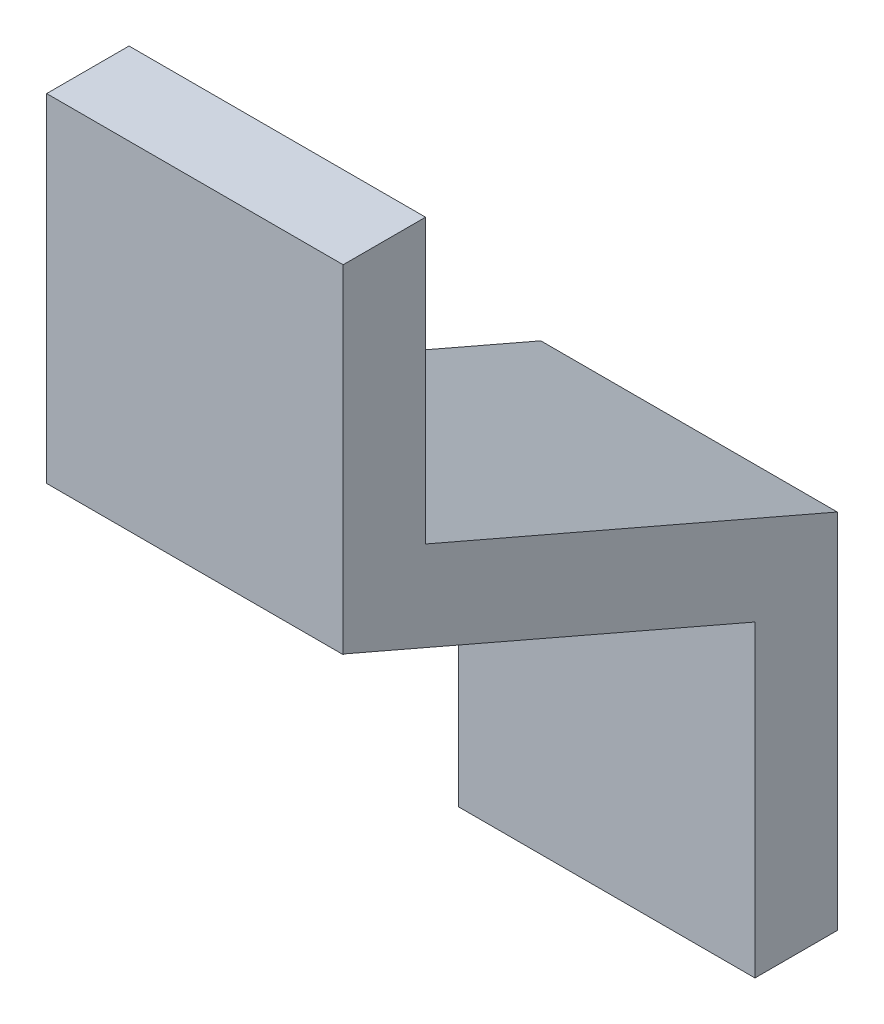
ISO-10303-21;
HEADER;
FILE_DESCRIPTION(('STEP AP214'),'2;1');
FILE_NAME('part.step','',(''),(''),'','','');
FILE_SCHEMA(('AUTOMOTIVE_DESIGN { 1 0 10303 214 1 1 1 1 }'));
ENDSEC;
DATA;
#1=APPLICATION_CONTEXT('core data for automotive mechanical design processes');
#2=APPLICATION_PROTOCOL_DEFINITION('international standard','automotive_design',2000,#1);
#3=PRODUCT_CONTEXT('',#1,'mechanical');
#4=PRODUCT('Part','Part','',(#3));
#5=PRODUCT_RELATED_PRODUCT_CATEGORY('part','',(#4));
#6=PRODUCT_DEFINITION_FORMATION('','',#4);
#7=PRODUCT_DEFINITION_CONTEXT('part definition',#1,'design');
#8=PRODUCT_DEFINITION('design','',#6,#7);
#9=PRODUCT_DEFINITION_SHAPE('','',#8);
#10=(LENGTH_UNIT() NAMED_UNIT(*) SI_UNIT(.MILLI.,.METRE.));
#11=(NAMED_UNIT(*) PLANE_ANGLE_UNIT() SI_UNIT($,.RADIAN.));
#12=(NAMED_UNIT(*) SI_UNIT($,.STERADIAN.) SOLID_ANGLE_UNIT());
#13=UNCERTAINTY_MEASURE_WITH_UNIT(LENGTH_MEASURE(1.E-05),#10,'distance_accuracy_value','');
#14=(GEOMETRIC_REPRESENTATION_CONTEXT(3) GLOBAL_UNCERTAINTY_ASSIGNED_CONTEXT((#13)) GLOBAL_UNIT_ASSIGNED_CONTEXT((#10,
#11,#12)) REPRESENTATION_CONTEXT('',''));
#15=CARTESIAN_POINT('',(0.,0.,0.));
#16=DIRECTION('',(0.,0.,1.));
#17=DIRECTION('',(1.,0.,0.));
#18=AXIS2_PLACEMENT_3D('',#15,#16,#17);
#19=CARTESIAN_POINT('',(6.62,0.999999996424,0.5));
#20=DIRECTION('',(0.,1.,0.));
#21=DIRECTION('',(0.,0.,1.));
#22=AXIS2_PLACEMENT_3D('',#19,#20,#21);
#23=PLANE('',#22);
#24=DIRECTION('',(1.,0.,0.));
#25=VECTOR('',#24,1.);
#26=CARTESIAN_POINT('',(6.62,0.999999996424,0.5));
#27=LINE('',#26,#25);
#28=CARTESIAN_POINT('',(6.980000014305,0.999999996424,0.5));
#29=VERTEX_POINT('',#28);
#30=CARTESIAN_POINT('',(6.62,0.999999996424,0.5));
#31=VERTEX_POINT('',#30);
#32=EDGE_CURVE('E140',#29,#31,#27,.F.);
#33=ORIENTED_EDGE('',*,*,#32,.T.);
#34=DIRECTION('',(0.,0.,-1.));
#35=VECTOR('',#34,1.);
#36=CARTESIAN_POINT('',(6.62,0.999999996424,0.));
#37=LINE('',#36,#35);
#38=CARTESIAN_POINT('',(6.62,0.999999996424,0.60000000149));
#39=VERTEX_POINT('',#38);
#40=EDGE_CURVE('E133',#31,#39,#37,.F.);
#41=ORIENTED_EDGE('',*,*,#40,.T.);
#42=DIRECTION('',(1.,0.,0.));
#43=VECTOR('',#42,1.);
#44=CARTESIAN_POINT('',(6.62,0.999999996424,0.60000000149));
#45=LINE('',#44,#43);
#46=CARTESIAN_POINT('',(6.980000014305,0.999999996424,0.60000000149));
#47=VERTEX_POINT('',#46);
#48=EDGE_CURVE('E129',#47,#39,#45,.F.);
#49=ORIENTED_EDGE('',*,*,#48,.F.);
#50=DIRECTION('',(0.,0.,-1.));
#51=VECTOR('',#50,1.);
#52=CARTESIAN_POINT('',(6.980000014305,0.999999996424,0.));
#53=LINE('',#52,#51);
#54=EDGE_CURVE('E106',#29,#47,#53,.F.);
#55=ORIENTED_EDGE('',*,*,#54,.F.);
#56=EDGE_LOOP('',(#33,#41,#49,#55));
#57=FACE_BOUND('',#56,.T.);
#58=ADVANCED_FACE('F17',(#57),#23,.T.);
#59=CARTESIAN_POINT('',(6.62,0.59,0.60000000149));
#60=DIRECTION('',(0.,0.,1.));
#61=DIRECTION('',(1.,0.,0.));
#62=AXIS2_PLACEMENT_3D('',#59,#60,#61);
#63=PLANE('',#62);
#64=DIRECTION('',(0.,1.,0.));
#65=VECTOR('',#64,1.);
#66=CARTESIAN_POINT('',(6.62,0.44,0.60000000149));
#67=LINE('',#66,#65);
#68=CARTESIAN_POINT('',(6.62,0.59,0.60000000149));
#69=VERTEX_POINT('',#68);
#70=EDGE_CURVE('E136',#39,#69,#67,.F.);
#71=ORIENTED_EDGE('',*,*,#70,.T.);
#72=DIRECTION('',(1.,0.,0.));
#73=VECTOR('',#72,1.);
#74=CARTESIAN_POINT('',(6.62,0.59,0.60000000149));
#75=LINE('',#74,#73);
#76=CARTESIAN_POINT('',(6.980000014305,0.59,0.60000000149));
#77=VERTEX_POINT('',#76);
#78=EDGE_CURVE('E92',#69,#77,#75,.T.);
#79=ORIENTED_EDGE('',*,*,#78,.T.);
#80=DIRECTION('',(0.,1.,0.));
#81=VECTOR('',#80,1.);
#82=CARTESIAN_POINT('',(6.980000014305,0.44,0.60000000149));
#83=LINE('',#82,#81);
#84=EDGE_CURVE('E73',#47,#77,#83,.F.);
#85=ORIENTED_EDGE('',*,*,#84,.F.);
#86=ORIENTED_EDGE('',*,*,#48,.T.);
#87=EDGE_LOOP('',(#71,#79,#85,#86));
#88=FACE_BOUND('',#87,.T.);
#89=ADVANCED_FACE('F285',(#88),#63,.T.);
#90=CARTESIAN_POINT('',(6.62,0.59,0.5));
#91=DIRECTION('',(0.,1.,0.));
#92=DIRECTION('',(0.,0.,1.));
#93=AXIS2_PLACEMENT_3D('',#90,#91,#92);
#94=PLANE('',#93);
#95=DIRECTION('',(1.,0.,0.));
#96=VECTOR('',#95,1.);
#97=CARTESIAN_POINT('',(6.62,0.590000000000416,0.59842599626982));
#98=LINE('',#97,#96);
#99=CARTESIAN_POINT('',(6.980000014305,0.590000000000104,0.598425996269911));
#100=VERTEX_POINT('',#99);
#101=CARTESIAN_POINT('',(6.62,0.590000000000104,0.59842599626991));
#102=VERTEX_POINT('',#101);
#103=EDGE_CURVE('E84',#100,#102,#98,.F.);
#104=ORIENTED_EDGE('',*,*,#103,.F.);
#105=DIRECTION('',(0.,0.,-1.));
#106=VECTOR('',#105,1.);
#107=CARTESIAN_POINT('',(6.980000014305,0.59,0.));
#108=LINE('',#107,#106);
#109=EDGE_CURVE('E20',#77,#100,#108,.T.);
#110=ORIENTED_EDGE('',*,*,#109,.F.);
#111=ORIENTED_EDGE('',*,*,#78,.F.);
#112=DIRECTION('',(0.,0.,1.));
#113=VECTOR('',#112,1.);
#114=CARTESIAN_POINT('',(6.62,0.59,0.5));
#115=LINE('',#114,#113);
#116=EDGE_CURVE('E87',#69,#102,#115,.F.);
#117=ORIENTED_EDGE('',*,*,#116,.T.);
#118=EDGE_LOOP('',(#104,#110,#111,#117));
#119=FACE_BOUND('',#118,.T.);
#120=ADVANCED_FACE('F85',(#119),#94,.F.);
#121=CARTESIAN_POINT('',(6.62,0.348224508223,0.03971472531736));
#122=DIRECTION('',(0.,-0.917754904098641,0.397147247255844));
#123=DIRECTION('',(0.,-0.397147247255844,-0.917754904098641));
#124=AXIS2_PLACEMENT_3D('',#121,#122,#123);
#125=PLANE('',#124);
#126=DIRECTION('',(0.,-0.397147247255413,-0.917754904098827));
#127=VECTOR('',#126,1.);
#128=CARTESIAN_POINT('',(6.980000014305,0.59,0.59842599627));
#129=LINE('',#128,#127);
#130=CARTESIAN_POINT('',(6.980000014305,0.37431222660502,0.10000000149));
#131=VERTEX_POINT('',#130);
#132=EDGE_CURVE('E80',#100,#131,#129,.T.);
#133=ORIENTED_EDGE('',*,*,#132,.F.);
#134=ORIENTED_EDGE('',*,*,#103,.T.);
#135=DIRECTION('',(0.,-0.397147247255413,-0.917754904098827));
#136=VECTOR('',#135,1.);
#137=CARTESIAN_POINT('',(6.62,0.59,0.59842599627));
#138=LINE('',#137,#136);
#139=CARTESIAN_POINT('',(6.62,0.374312226605,0.10000000149));
#140=VERTEX_POINT('',#139);
#141=EDGE_CURVE('E122',#102,#140,#138,.T.);
#142=ORIENTED_EDGE('',*,*,#141,.T.);
#143=DIRECTION('',(1.,0.,0.));
#144=VECTOR('',#143,1.);
#145=CARTESIAN_POINT('',(6.62,0.374312226605,0.10000000149));
#146=LINE('',#145,#144);
#147=EDGE_CURVE('E91',#131,#140,#146,.F.);
#148=ORIENTED_EDGE('',*,*,#147,.F.);
#149=EDGE_LOOP('',(#133,#134,#142,#148));
#150=FACE_BOUND('',#149,.T.);
#151=ADVANCED_FACE('F94',(#150),#125,.T.);
#152=CARTESIAN_POINT('',(6.62,0.,0.10000000149));
#153=DIRECTION('',(0.,0.,1.));
#154=DIRECTION('',(1.,0.,0.));
#155=AXIS2_PLACEMENT_3D('',#152,#153,#154);
#156=PLANE('',#155);
#157=ORIENTED_EDGE('',*,*,#147,.T.);
#158=DIRECTION('',(0.,1.,0.));
#159=VECTOR('',#158,1.);
#160=CARTESIAN_POINT('',(6.62,0.44,0.10000000149));
#161=LINE('',#160,#159);
#162=CARTESIAN_POINT('',(6.62,0.,0.10000000149));
#163=VERTEX_POINT('',#162);
#164=EDGE_CURVE('E118',#140,#163,#161,.F.);
#165=ORIENTED_EDGE('',*,*,#164,.T.);
#166=DIRECTION('',(1.,0.,0.));
#167=VECTOR('',#166,1.);
#168=CARTESIAN_POINT('',(6.62,0.,0.10000000149));
#169=LINE('',#168,#167);
#170=CARTESIAN_POINT('',(6.980000014305,0.,0.10000000149));
#171=VERTEX_POINT('',#170);
#172=EDGE_CURVE('E115',#163,#171,#169,.T.);
#173=ORIENTED_EDGE('',*,*,#172,.T.);
#174=DIRECTION('',(0.,1.,0.));
#175=VECTOR('',#174,1.);
#176=CARTESIAN_POINT('',(6.980000014305,0.44,0.10000000149));
#177=LINE('',#176,#175);
#178=EDGE_CURVE('E96',#131,#171,#177,.F.);
#179=ORIENTED_EDGE('',*,*,#178,.F.);
#180=EDGE_LOOP('',(#157,#165,#173,#179));
#181=FACE_BOUND('',#180,.T.);
#182=ADVANCED_FACE('F202',(#181),#156,.T.);
#183=CARTESIAN_POINT('',(6.62,0.,0.));
#184=DIRECTION('',(0.,1.,0.));
#185=DIRECTION('',(0.,0.,1.));
#186=AXIS2_PLACEMENT_3D('',#183,#184,#185);
#187=PLANE('',#186);
#188=DIRECTION('',(0.,0.,-1.));
#189=VECTOR('',#188,1.);
#190=CARTESIAN_POINT('',(6.62,0.,0.));
#191=LINE('',#190,#189);
#192=CARTESIAN_POINT('',(6.62,0.,0.));
#193=VERTEX_POINT('',#192);
#194=EDGE_CURVE('E121',#163,#193,#191,.T.);
#195=ORIENTED_EDGE('',*,*,#194,.T.);
#196=DIRECTION('',(1.,0.,0.));
#197=VECTOR('',#196,1.);
#198=CARTESIAN_POINT('',(6.62,0.,0.));
#199=LINE('',#198,#197);
#200=CARTESIAN_POINT('',(6.980000014305,0.,0.));
#201=VERTEX_POINT('',#200);
#202=EDGE_CURVE('E112',#193,#201,#199,.T.);
#203=ORIENTED_EDGE('',*,*,#202,.T.);
#204=DIRECTION('',(0.,0.,-1.));
#205=VECTOR('',#204,1.);
#206=CARTESIAN_POINT('',(6.980000014305,0.,0.));
#207=LINE('',#206,#205);
#208=EDGE_CURVE('E98',#171,#201,#207,.T.);
#209=ORIENTED_EDGE('',*,*,#208,.F.);
#210=ORIENTED_EDGE('',*,*,#172,.F.);
#211=EDGE_LOOP('',(#195,#203,#209,#210));
#212=FACE_BOUND('',#211,.T.);
#213=ADVANCED_FACE('F206',(#212),#187,.F.);
#214=CARTESIAN_POINT('',(6.62,0.,0.));
#215=DIRECTION('',(0.,0.,1.));
#216=DIRECTION('',(1.,0.,0.));
#217=AXIS2_PLACEMENT_3D('',#214,#215,#216);
#218=PLANE('',#217);
#219=ORIENTED_EDGE('',*,*,#202,.F.);
#220=DIRECTION('',(0.,1.,0.));
#221=VECTOR('',#220,1.);
#222=CARTESIAN_POINT('',(6.62,0.44,0.));
#223=LINE('',#222,#221);
#224=CARTESIAN_POINT('',(6.62,0.439999998997445,-1.94673175919965E-10));
#225=VERTEX_POINT('',#224);
#226=EDGE_CURVE('E178',#193,#225,#223,.T.);
#227=ORIENTED_EDGE('',*,*,#226,.T.);
#228=DIRECTION('',(1.,0.,0.));
#229=VECTOR('',#228,1.);
#230=CARTESIAN_POINT('',(6.62,0.43999999966303,-7.78692710220355E-10));
#231=LINE('',#230,#229);
#232=CARTESIAN_POINT('',(6.980000014305,0.439999998997445,-1.94673175919965E-10));
#233=VERTEX_POINT('',#232);
#234=EDGE_CURVE('E163',#225,#233,#231,.T.);
#235=ORIENTED_EDGE('',*,*,#234,.T.);
#236=DIRECTION('',(0.,1.,0.));
#237=VECTOR('',#236,1.);
#238=CARTESIAN_POINT('',(6.980000014305,0.44,0.));
#239=LINE('',#238,#237);
#240=EDGE_CURVE('E109',#201,#233,#239,.T.);
#241=ORIENTED_EDGE('',*,*,#240,.F.);
#242=EDGE_LOOP('',(#219,#227,#235,#241));
#243=FACE_BOUND('',#242,.T.);
#244=ADVANCED_FACE('F186',(#243),#218,.F.);
#245=CARTESIAN_POINT('',(6.980000014305,0.44,0.));
#246=DIRECTION('',(1.,0.,0.));
#247=DIRECTION('',(0.,0.,-1.));
#248=AXIS2_PLACEMENT_3D('',#245,#246,#247);
#249=PLANE('',#248);
#250=ORIENTED_EDGE('',*,*,#178,.T.);
#251=ORIENTED_EDGE('',*,*,#208,.T.);
#252=ORIENTED_EDGE('',*,*,#240,.T.);
#253=DIRECTION('',(0.,-0.397147247255844,-0.917754904098641));
#254=VECTOR('',#253,1.);
#255=CARTESIAN_POINT('',(6.980000014305,0.44,0.));
#256=LINE('',#255,#254);
#257=CARTESIAN_POINT('',(6.980000014305,0.656368904967003,0.499999999999999));
#258=VERTEX_POINT('',#257);
#259=EDGE_CURVE('E151',#233,#258,#256,.F.);
#260=ORIENTED_EDGE('',*,*,#259,.T.);
#261=DIRECTION('',(0.,1.,0.));
#262=VECTOR('',#261,1.);
#263=CARTESIAN_POINT('',(6.980000014305,0.59,0.5));
#264=LINE('',#263,#262);
#265=EDGE_CURVE('E144',#258,#29,#264,.T.);
#266=ORIENTED_EDGE('',*,*,#265,.T.);
#267=ORIENTED_EDGE('',*,*,#54,.T.);
#268=ORIENTED_EDGE('',*,*,#84,.T.);
#269=ORIENTED_EDGE('',*,*,#109,.T.);
#270=ORIENTED_EDGE('',*,*,#132,.T.);
#271=EDGE_LOOP('',(#250,#251,#252,#260,#266,#267,#268,#269,#270));
#272=FACE_BOUND('',#271,.T.);
#273=ADVANCED_FACE('F78',(#272),#249,.T.);
#274=CARTESIAN_POINT('',(6.62,0.59,0.5));
#275=DIRECTION('',(0.,0.,1.));
#276=DIRECTION('',(1.,0.,0.));
#277=AXIS2_PLACEMENT_3D('',#274,#275,#276);
#278=PLANE('',#277);
#279=ORIENTED_EDGE('',*,*,#265,.F.);
#280=DIRECTION('',(1.,0.,0.));
#281=VECTOR('',#280,1.);
#282=CARTESIAN_POINT('',(6.62,0.656368904967005,0.499999999999998));
#283=LINE('',#282,#281);
#284=CARTESIAN_POINT('',(6.62,0.656368904967001,0.5));
#285=VERTEX_POINT('',#284);
#286=EDGE_CURVE('E26',#258,#285,#283,.F.);
#287=ORIENTED_EDGE('',*,*,#286,.T.);
#288=DIRECTION('',(0.,1.,0.));
#289=VECTOR('',#288,1.);
#290=CARTESIAN_POINT('',(6.62,0.44,0.5));
#291=LINE('',#290,#289);
#292=EDGE_CURVE('E34',#285,#31,#291,.T.);
#293=ORIENTED_EDGE('',*,*,#292,.T.);
#294=ORIENTED_EDGE('',*,*,#32,.F.);
#295=EDGE_LOOP('',(#279,#287,#293,#294));
#296=FACE_BOUND('',#295,.T.);
#297=ADVANCED_FACE('F212',(#296),#278,.F.);
#298=CARTESIAN_POINT('',(6.62,0.44,0.));
#299=DIRECTION('',(1.,0.,0.));
#300=DIRECTION('',(0.,0.,-1.));
#301=AXIS2_PLACEMENT_3D('',#298,#299,#300);
#302=PLANE('',#301);
#303=ORIENTED_EDGE('',*,*,#226,.F.);
#304=ORIENTED_EDGE('',*,*,#194,.F.);
#305=ORIENTED_EDGE('',*,*,#164,.F.);
#306=ORIENTED_EDGE('',*,*,#141,.F.);
#307=ORIENTED_EDGE('',*,*,#116,.F.);
#308=ORIENTED_EDGE('',*,*,#70,.F.);
#309=ORIENTED_EDGE('',*,*,#40,.F.);
#310=ORIENTED_EDGE('',*,*,#292,.F.);
#311=DIRECTION('',(0.,-0.397147247255844,-0.917754904098641));
#312=VECTOR('',#311,1.);
#313=CARTESIAN_POINT('',(6.62,0.44,0.));
#314=LINE('',#313,#312);
#315=EDGE_CURVE('E11',#285,#225,#314,.T.);
#316=ORIENTED_EDGE('',*,*,#315,.T.);
#317=EDGE_LOOP('',(#303,#304,#305,#306,#307,#308,#309,#310,#316));
#318=FACE_BOUND('',#317,.T.);
#319=ADVANCED_FACE('F207',(#318),#302,.F.);
#320=CARTESIAN_POINT('',(6.62,0.44,0.));
#321=DIRECTION('',(0.,-0.917754904098641,0.397147247255844));
#322=DIRECTION('',(0.,-0.397147247255844,-0.917754904098641));
#323=AXIS2_PLACEMENT_3D('',#320,#321,#322);
#324=PLANE('',#323);
#325=ORIENTED_EDGE('',*,*,#286,.F.);
#326=ORIENTED_EDGE('',*,*,#259,.F.);
#327=ORIENTED_EDGE('',*,*,#234,.F.);
#328=ORIENTED_EDGE('',*,*,#315,.F.);
#329=EDGE_LOOP('',(#325,#326,#327,#328));
#330=FACE_BOUND('',#329,.T.);
#331=ADVANCED_FACE('F193',(#330),#324,.F.);
#332=CLOSED_SHELL('',(#58,#89,#120,#151,#182,#213,#244,#273,#297,#319,#331));
#333=MANIFOLD_SOLID_BREP('B1',#332);
#334=ADVANCED_BREP_SHAPE_REPRESENTATION('',(#18,#333),#14);
#335=SHAPE_DEFINITION_REPRESENTATION(#9,#334);
ENDSEC;
END-ISO-10303-21;
